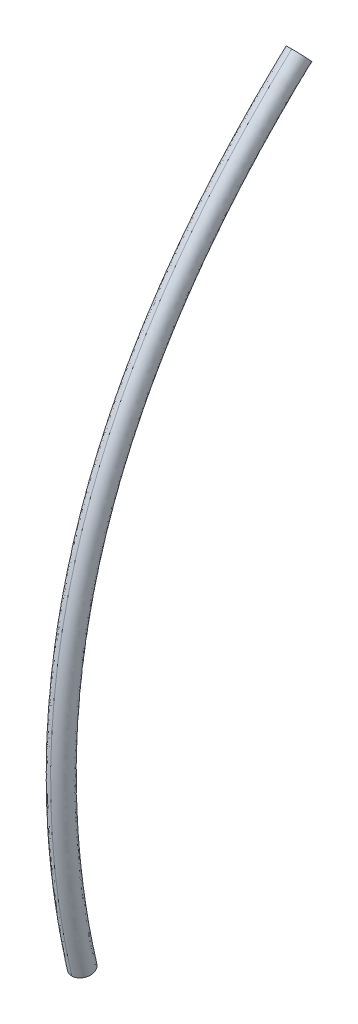
ISO-10303-21;
HEADER;
FILE_DESCRIPTION(('STEP AP214'),'2;1');
FILE_NAME('part.step','',(''),(''),'','','');
FILE_SCHEMA(('AUTOMOTIVE_DESIGN { 1 0 10303 214 1 1 1 1 }'));
ENDSEC;
DATA;
#1=APPLICATION_CONTEXT('core data for automotive mechanical design processes');
#2=APPLICATION_PROTOCOL_DEFINITION('international standard','automotive_design',2000,#1);
#3=PRODUCT_CONTEXT('',#1,'mechanical');
#4=PRODUCT('Part','Part','',(#3));
#5=PRODUCT_RELATED_PRODUCT_CATEGORY('part','',(#4));
#6=PRODUCT_DEFINITION_FORMATION('','',#4);
#7=PRODUCT_DEFINITION_CONTEXT('part definition',#1,'design');
#8=PRODUCT_DEFINITION('design','',#6,#7);
#9=PRODUCT_DEFINITION_SHAPE('','',#8);
#10=(LENGTH_UNIT() NAMED_UNIT(*) SI_UNIT(.MILLI.,.METRE.));
#11=(NAMED_UNIT(*) PLANE_ANGLE_UNIT() SI_UNIT($,.RADIAN.));
#12=(NAMED_UNIT(*) SI_UNIT($,.STERADIAN.) SOLID_ANGLE_UNIT());
#13=UNCERTAINTY_MEASURE_WITH_UNIT(LENGTH_MEASURE(1.E-05),#10,'distance_accuracy_value','');
#14=(GEOMETRIC_REPRESENTATION_CONTEXT(3) GLOBAL_UNCERTAINTY_ASSIGNED_CONTEXT((#13)) GLOBAL_UNIT_ASSIGNED_CONTEXT((#10,
#11,#12)) REPRESENTATION_CONTEXT('',''));
#15=CARTESIAN_POINT('',(0.,0.,0.));
#16=DIRECTION('',(0.,0.,1.));
#17=DIRECTION('',(1.,0.,0.));
#18=AXIS2_PLACEMENT_3D('',#15,#16,#17);
#19=CARTESIAN_POINT('',(-71.89158931535,31.2153070087,3.940002599999));
#20=DIRECTION('',(-3.37450176063713E-05,0.676622103447027,-0.736330447549329));
#21=DIRECTION('',(0.,0.736330447968568,0.67662210383227));
#22=AXIS2_PLACEMENT_3D('',#19,#20,#21);
#23=PLANE('',#22);
#24=CARTESIAN_POINT('',(-71.8915985028972,31.3993896203581,4.10915812607117));
#25=CARTESIAN_POINT('',(-71.9056627049007,31.399397713496,4.10916620748723));
#26=CARTESIAN_POINT('',(-71.9197232970163,31.3985148582398,4.10835558651192));
#27=CARTESIAN_POINT('',(-71.9474366475242,31.3950320780008,4.10515649171487));
#28=CARTESIAN_POINT('',(-71.9610896967661,31.3924334097169,4.10276917270087));
#29=CARTESIAN_POINT('',(-71.9876152248778,31.3855820653723,4.09647461306001));
#30=CARTESIAN_POINT('',(-72.0004873383897,31.3813286219244,4.09256666725597));
#31=CARTESIAN_POINT('',(-72.025076820214,31.3712922912606,4.08334530011746));
#32=CARTESIAN_POINT('',(-72.0367944147661,31.3655097045171,4.07803215490075));
#33=CARTESIAN_POINT('',(-72.0587383575653,31.3525820226663,4.0661537722847));
#34=CARTESIAN_POINT('',(-72.0689656000591,31.345437750592,4.05958929122033));
#35=CARTESIAN_POINT('',(-72.0876605661599,31.3299762300138,4.0453823875822));
#36=CARTESIAN_POINT('',(-72.0961258023464,31.3216573507353,4.03773846635778));
#37=CARTESIAN_POINT('',(-72.1110276587687,31.3041028159088,4.02160809519705));
#38=CARTESIAN_POINT('',(-72.1174670486452,31.2948684349217,4.01312281659556));
#39=CARTESIAN_POINT('',(-72.128157758151,31.2757221402713,3.99552956692825));
#40=CARTESIAN_POINT('',(-72.1324061168707,31.2658093301656,3.98642077197598));
#41=CARTESIAN_POINT('',(-72.1385787187361,31.2456059628344,3.96785595959955));
#42=CARTESIAN_POINT('',(-72.1405045241625,31.2353156643351,3.95840017999339));
#43=CARTESIAN_POINT('',(-72.1419826046852,31.2146431094734,3.93940401091891));
#44=CARTESIAN_POINT('',(-72.1415348797274,31.2042608531088,3.92986362144866));
#45=CARTESIAN_POINT('',(-72.1382774680916,31.1836921387668,3.91096265554266));
#46=CARTESIAN_POINT('',(-72.1354661913133,31.1735058173266,3.90160220449954));
#47=CARTESIAN_POINT('',(-72.1275648907312,31.1536392128044,3.88334620216467));
#48=CARTESIAN_POINT('',(-72.1224779385629,31.1439582671858,3.87445004220157));
#49=CARTESIAN_POINT('',(-72.1101617775071,31.1253492268747,3.85734942705056));
#50=CARTESIAN_POINT('',(-72.1029296363858,31.1164221842812,3.84914593851362));
#51=CARTESIAN_POINT('',(-72.0865428336147,31.0996015163003,3.83368849170903));
#52=CARTESIAN_POINT('',(-72.0773908718937,31.0917064646233,3.82643322293208));
#53=CARTESIAN_POINT('',(-72.0574037349204,31.0771485953598,3.81305492162478));
#54=CARTESIAN_POINT('',(-72.046566217646,31.0704875209944,3.80693349085206));
#55=CARTESIAN_POINT('',(-72.0235413560115,31.0586092308483,3.79601734489456));
#56=CARTESIAN_POINT('',(-72.011355927105,31.0533900021219,3.79122078007981));
#57=CARTESIAN_POINT('',(-71.9859508532943,31.0445239279692,3.78307248326935));
#58=CARTESIAN_POINT('',(-71.9727297145094,31.0408794050886,3.77972288541792));
#59=CARTESIAN_POINT('',(-71.945660491522,31.035283560126,3.77457956171973));
#60=CARTESIAN_POINT('',(-71.9318133990819,31.0333296519797,3.77278345955569));
#61=CARTESIAN_POINT('',(-71.9091218774411,31.0315624580655,3.77115852581408));
#62=CARTESIAN_POINT('',(-71.9003486755683,31.0312212099147,3.77084454709132));
#63=CARTESIAN_POINT('',(-71.8915801013255,31.0312243970436,3.77084707392716));
#64=B_SPLINE_CURVE_WITH_KNOTS('',3,(#24,#25,#26,#27,#28,#29,#30,#31,#32,#33,#34,#35,#36,#37,#38,
#39,#40,#41,#42,#43,#44,#45,#46,#47,#48,#49,#50,#51,#52,#53,#54,#55,#56,#57,#58,#59,#60,#61,#62,
#63),.UNSPECIFIED.,.F.,.F.,(4,2,2,2,2,2,2,2,2,2,2,2,2,2,2,2,2,2,2,4),(0.,0.0421365633228405,
0.0842422990895157,0.126367584333735,0.168484598219411,0.210576235910812,0.252726897195098,
0.294819679123878,0.336969196202288,0.379090345288036,0.421211495332161,0.463361005444274,
0.505453794321988,0.547604386585764,0.58969609331148,0.631846816313811,0.67393839227596,
0.716091839251991,0.758180691248295,0.784486390547571),.UNSPECIFIED.);
#65=CARTESIAN_POINT('',(-71.8915985028972,31.3993896203582,4.10915812607066));
#66=VERTEX_POINT('',#65);
#67=CARTESIAN_POINT('',(-71.8915801013255,31.0312243970432,3.77084707392589));
#68=VERTEX_POINT('',#67);
#69=EDGE_CURVE('E45',#66,#68,#64,.T.);
#70=ORIENTED_EDGE('',*,*,#69,.F.);
#71=CARTESIAN_POINT('',(-71.8915801013255,31.0312243970422,3.77084707392589));
#72=CARTESIAN_POINT('',(-71.8775158993207,31.0312163050009,3.77083899351744));
#73=CARTESIAN_POINT('',(-71.863455307332,31.0320991613533,3.77164961550012));
#74=CARTESIAN_POINT('',(-71.8357419573246,31.035581943753,3.7748487122827));
#75=CARTESIAN_POINT('',(-71.8220889084563,31.0381806131014,3.77723603227488));
#76=CARTESIAN_POINT('',(-71.7955633813295,31.0450319595141,3.78353059381619));
#77=CARTESIAN_POINT('',(-71.7826912684292,31.0492854039656,3.78743854054248));
#78=CARTESIAN_POINT('',(-71.7581017880479,31.0593217365465,3.79665990944275));
#79=CARTESIAN_POINT('',(-71.7463841943272,31.0651043242036,3.80197305549901));
#80=CARTESIAN_POINT('',(-71.7244402533869,31.0780320077653,3.81385143968731));
#81=CARTESIAN_POINT('',(-71.7142130119204,31.085176280637,3.82041592148446));
#82=CARTESIAN_POINT('',(-71.695518048043,31.1006378026728,3.83462282646207));
#83=CARTESIAN_POINT('',(-71.6870528130527,31.1089566826113,3.84226674829303));
#84=CARTESIAN_POINT('',(-71.6721509591547,31.1265112185996,3.85839712052148));
#85=CARTESIAN_POINT('',(-71.6657115706062,31.1357456000888,3.86688239958436));
#86=CARTESIAN_POINT('',(-71.6550208638536,31.1548918955726,3.88447565001769));
#87=CARTESIAN_POINT('',(-71.6507725065593,31.1648047060095,3.89358444527438));
#88=CARTESIAN_POINT('',(-71.6445999075992,31.185008073822,3.91214925809315));
#89=CARTESIAN_POINT('',(-71.6426741036525,31.1952983724714,3.92160503783733));
#90=CARTESIAN_POINT('',(-71.6411960261026,31.2159709274484,3.94060120701783));
#91=CARTESIAN_POINT('',(-71.6416437525534,31.226353183778,3.95014159645607));
#92=CARTESIAN_POINT('',(-71.6449011671473,31.2469218978657,3.96904256212854));
#93=CARTESIAN_POINT('',(-71.6477124453904,31.2571082190865,3.97840301297003));
#94=CARTESIAN_POINT('',(-71.6556137488295,31.2769748229921,3.99665901473842));
#95=CARTESIAN_POINT('',(-71.6607007023901,31.2866557682138,4.00555517433687));
#96=CARTESIAN_POINT('',(-71.6730168661218,31.3052648075641,4.02265578860514));
#97=CARTESIAN_POINT('',(-71.6802490085267,31.3141918495934,4.03085927662376));
#98=CARTESIAN_POINT('',(-71.6966358137165,31.3310125162963,4.04631672225406));
#99=CARTESIAN_POINT('',(-71.7057877765726,31.3389075672596,4.05357199037523));
#100=CARTESIAN_POINT('',(-71.7257749156395,31.3534654349652,4.06695029025106));
#101=CARTESIAN_POINT('',(-71.7366124338724,31.3601265084861,4.07307172024781));
#102=CARTESIAN_POINT('',(-71.7596372972164,31.3720047968376,4.08398786455629));
#103=CARTESIAN_POINT('',(-71.7718227268741,31.3772240246141,4.08878442849826));
#104=CARTESIAN_POINT('',(-71.7972278019721,31.3860900967908,4.09693272349293));
#105=CARTESIAN_POINT('',(-71.8104489412937,31.3897346186432,4.10028232039958));
#106=CARTESIAN_POINT('',(-71.8375181650969,31.3953304614937,4.10542564215699));
#107=CARTESIAN_POINT('',(-71.8513652578149,31.39728436856,4.1072217433286));
#108=CARTESIAN_POINT('',(-71.8740567621262,31.3990515593315,4.10884667418155));
#109=CARTESIAN_POINT('',(-71.8828299463016,31.3993928067877,4.10916065226525));
#110=CARTESIAN_POINT('',(-71.8915985028971,31.3993896203567,4.10915812606985));
#111=B_SPLINE_CURVE_WITH_KNOTS('',3,(#71,#72,#73,#74,#75,#76,#77,#78,#79,#80,#81,#82,#83,#84,
#85,#86,#87,#88,#89,#90,#91,#92,#93,#94,#95,#96,#97,#98,#99,#100,#101,#102,#103,#104,#105,#106,
#107,#108,#109,#110),.UNSPECIFIED.,.F.,.F.,(4,2,2,2,2,2,2,2,2,2,2,2,2,2,2,2,2,2,2,4),(0.,
0.0421365633230519,0.0842422990899736,0.126367584334418,0.168484598220306,0.210576235911809,
0.252726897196176,0.294819679124971,0.336969196203423,0.37909034528927,0.421211495333465,
0.463361005444602,0.505453794321359,0.547604386584339,0.589696093309071,0.631846816314479,
0.673938392276347,0.716091839300921,0.75818069125102,0.784486337678304),.UNSPECIFIED.);
#112=EDGE_CURVE('E55',#68,#66,#111,.T.);
#113=ORIENTED_EDGE('',*,*,#112,.F.);
#114=EDGE_LOOP('',(#70,#113));
#115=FACE_BOUND('',#114,.T.);
#116=ADVANCED_FACE('F17',(#115),#23,.T.);
#117=CARTESIAN_POINT('',(-71.87003044763,15.10063833545,8.737419710806));
#118=CARTESIAN_POINT('',(-71.87003328653,15.15748307275,8.750926323371));
#119=CARTESIAN_POINT('',(-71.87010384542,16.57168130498,9.080901965091));
#120=CARTESIAN_POINT('',(-71.87024258999,19.35463551411,9.422687421576));
#121=CARTESIAN_POINT('',(-71.87044063809,23.32540682278,8.937735265622));
#122=CARTESIAN_POINT('',(-71.87063855051,27.29231680901,7.219236763469));
#123=CARTESIAN_POINT('',(-71.87076552618,29.83920005819,5.079698170652));
#124=CARTESIAN_POINT('',(-71.87082892875,31.11090411614,3.685080689482));
#125=CARTESIAN_POINT('',(-71.87083089292,31.15032055346,3.641521866132));
#126=CARTESIAN_POINT('',(-72.02577822116,15.10362997508,8.72479608301));
#127=CARTESIAN_POINT('',(-72.02578102916,15.16044072749,8.738294621932));
#128=CARTESIAN_POINT('',(-72.02585132862,16.5737873244,9.068071542992));
#129=CARTESIAN_POINT('',(-72.02599034233,19.35475574699,9.409580594666));
#130=CARTESIAN_POINT('',(-72.02618810075,23.3219363323,8.925030849315));
#131=CARTESIAN_POINT('',(-72.02638529358,27.28519722054,7.20815229394));
#132=CARTESIAN_POINT('',(-72.02651251458,29.83031111924,5.070180947851));
#133=CARTESIAN_POINT('',(-72.02657603772,31.10129764379,3.676350378446));
#134=CARTESIAN_POINT('',(-72.02657801305,31.14069200991,3.632815944906));
#135=CARTESIAN_POINT('',(-72.14078463519,15.07916101315,8.827754648646));
#136=CARTESIAN_POINT('',(-72.14078743544,15.13624894699,8.841319036362));
#137=CARTESIAN_POINT('',(-72.14085792112,16.55654149901,9.172716727176));
#138=CARTESIAN_POINT('',(-72.14099801444,19.3537060369,9.516480142121));
#139=CARTESIAN_POINT('',(-72.14119715177,23.35017263521,9.028648327694));
#140=CARTESIAN_POINT('',(-72.14139543194,27.34319564128,7.298557453372));
#141=CARTESIAN_POINT('',(-72.14152361895,29.90274039844,5.147803611023));
#142=CARTESIAN_POINT('',(-72.14158754943,31.17957913992,3.747554973224));
#143=CARTESIAN_POINT('',(-72.14158954278,31.2191535192,3.703821615895));
#144=CARTESIAN_POINT('',(-72.14078283337,15.04303259343,8.979808602883));
#145=CARTESIAN_POINT('',(-72.14078565403,15.10052988157,8.99347023913));
#146=CARTESIAN_POINT('',(-72.14085665131,16.53108054015,9.327261557407));
#147=CARTESIAN_POINT('',(-72.14099793755,19.35216424749,9.674354319914));
#148=CARTESIAN_POINT('',(-72.14119923192,23.39188177935,9.181675394633));
#149=CARTESIAN_POINT('',(-72.1413997042,27.42885885248,7.432071958844));
#150=CARTESIAN_POINT('',(-72.14152895411,30.00971576644,5.262440336979));
#151=CARTESIAN_POINT('',(-72.14159331563,31.29519733158,3.852713200022));
#152=CARTESIAN_POINT('',(-72.14159532224,31.33503756258,3.808686062873));
#153=CARTESIAN_POINT('',(-72.14078103154,15.00690417371,9.13186255712));
#154=CARTESIAN_POINT('',(-72.14078387263,15.06481081615,9.145621441899));
#155=CARTESIAN_POINT('',(-72.1408553815,16.50561958129,9.481806387637));
#156=CARTESIAN_POINT('',(-72.14099786066,19.35062245808,9.832228497708));
#157=CARTESIAN_POINT('',(-72.14120131207,23.43359092349,9.334702461572));
#158=CARTESIAN_POINT('',(-72.14140397646,27.51452206368,7.565586464315));
#159=CARTESIAN_POINT('',(-72.14153428927,30.11669113444,5.377077062935));
#160=CARTESIAN_POINT('',(-72.14159908183,31.41081552323,3.957871426819));
#161=CARTESIAN_POINT('',(-72.1416011017,31.45092160595,3.913550509852));
#162=CARTESIAN_POINT('',(-72.02577217742,14.98244668328,9.234821122756));
#163=CARTESIAN_POINT('',(-72.02577505389,15.04063050714,9.248645856328));
#164=CARTESIAN_POINT('',(-72.02584706938,16.48838522737,9.586451571821));
#165=CARTESIAN_POINT('',(-72.02599008441,19.34958421949,9.939128045162));
#166=CARTESIAN_POINT('',(-72.02619507807,23.4618386979,9.438319939951));
#167=CARTESIAN_POINT('',(-72.02639962376,27.57253195588,7.655991623747));
#168=CARTESIAN_POINT('',(-72.02653040996,30.18913188512,5.454699726106));
#169=CARTESIAN_POINT('',(-72.02659537892,31.48910849086,4.029076021598));
#170=CARTESIAN_POINT('',(-72.02659739872,31.52939458674,3.984556180841));
#171=CARTESIAN_POINT('',(-71.87002470307,14.98545385803,9.22219749496));
#172=CARTESIAN_POINT('',(-71.87002760705,15.04360369701,9.236014154889));
#173=CARTESIAN_POINT('',(-71.87009979703,16.4905067819,9.573621149722));
#174=CARTESIAN_POINT('',(-71.87024234484,19.34971998752,9.926021218252));
#175=CARTESIAN_POINT('',(-71.87044727002,23.45838374255,9.425615523643));
#176=CARTESIAN_POINT('',(-71.87065217132,27.56542790249,7.644907154218));
#177=CARTESIAN_POINT('',(-71.87078253571,30.18025848128,5.445182503305));
#178=CARTESIAN_POINT('',(-71.87084731252,31.47951755364,4.020345710561));
#179=CARTESIAN_POINT('',(-71.87084931896,31.51978157832,3.975850259615));
#180=(BOUNDED_SURFACE() B_SPLINE_SURFACE(3,3,((#117,#118,#119,#120,#121,#122,#123,#124,#125),
(#126,#127,#128,#129,#130,#131,#132,#133,#134),(#135,#136,#137,#138,#139,#140,#141,#142,#143),
(#144,#145,#146,#147,#148,#149,#150,#151,#152),(#153,#154,#155,#156,#157,#158,#159,#160,#161),
(#162,#163,#164,#165,#166,#167,#168,#169,#170),(#171,#172,#173,#174,#175,#176,#177,#178,#179)),
.UNSPECIFIED.,.F.,.F.,.F.) B_SPLINE_SURFACE_WITH_KNOTS((4,3,4),(4,1,1,1,1,1,4),(0.,1.,2.),
(-0.009188194403795,0.,0.2197220715086,0.4577543156428,0.7180322441343,1.,1.009035688199),
.UNSPECIFIED.) GEOMETRIC_REPRESENTATION_ITEM() RATIONAL_B_SPLINE_SURFACE(((1.192521483357,
1.192521483357,1.192521483357,1.192521483357,1.192521483357,1.192521483357,1.192521483357,
1.192521483357,1.192521483357),(0.9358261722145,0.9358261722145,0.9358261722145,0.9358261722145,
0.9358261722145,0.9358261722145,0.9358261722145,0.9358261722145,0.9358261722145),
(0.9358261722145,0.9358261722145,0.9358261722145,0.9358261722145,0.9358261722145,
0.9358261722145,0.9358261722145,0.9358261722145,0.9358261722145),(1.192521483357,1.192521483357,
1.192521483357,1.192521483357,1.192521483357,1.192521483357,1.192521483357,1.192521483357,
1.192521483357),(0.9358261722145,0.9358261722145,0.9358261722145,0.9358261722145,
0.9358261722145,0.9358261722145,0.9358261722145,0.9358261722145,0.9358261722145),
(0.9358261722145,0.9358261722145,0.9358261722145,0.9358261722145,0.9358261722145,
0.9358261722145,0.9358261722145,0.9358261722145,0.9358261722145),(1.192521483357,1.192521483357,
1.192521483357,1.192521483357,1.192521483357,1.192521483357,1.192521483357,1.192521483357,1.192521483357))) REPRESENTATION_ITEM('') SURFACE());
#181=CARTESIAN_POINT('',(-71.8907856421035,15.100836807745,8.73658004246828));
#182=CARTESIAN_POINT('',(-71.8907884769927,15.157679284519,8.75008611800995));
#183=CARTESIAN_POINT('',(-71.8908590041491,16.571820869703,9.08004854170349));
#184=CARTESIAN_POINT('',(-71.8909977911969,19.3546429930183,9.42181561295311));
#185=CARTESIAN_POINT('',(-71.8911958126441,23.325175462522,8.93689022358697));
#186=CARTESIAN_POINT('',(-71.8913936413216,27.2918427267683,7.21849947318648));
#187=CARTESIAN_POINT('',(-71.8915206555703,29.8386082865201,5.0790651267459));
#188=CARTESIAN_POINT('',(-71.8915840765926,31.1102646172882,3.68449998749413));
#189=CARTESIAN_POINT('',(-71.8915860423258,31.1496795865288,3.64094278644728));
#190=(BOUNDED_CURVE() B_SPLINE_CURVE(3,(#181,#182,#183,#184,#185,#186,#187,#188,#189),
.UNSPECIFIED.,.F.,.F.) B_SPLINE_CURVE_WITH_KNOTS((4,1,1,1,1,1,4),(-0.009188194403795,0.,
0.2197220715086,0.4577543156428,0.7180322441343,1.,1.009035688199),
.UNSPECIFIED.) CURVE() GEOMETRIC_REPRESENTATION_ITEM() RATIONAL_B_SPLINE_CURVE((1.1521574413996,
1.1521574413996,1.1521574413996,1.1521574413996,1.1521574413996,1.1521574413996,1.1521574413996,
1.1521574413996,1.1521574413996)) REPRESENTATION_ITEM(''));
#191=CARTESIAN_POINT('',(-71.890794118083,15.2711228978366,8.77631306650731));
#192=VERTEX_POINT('',#191);
#193=EDGE_CURVE('E49',#192,#68,#190,.T.);
#194=CARTESIAN_POINT('',(-71.8907941180829,15.2711228978371,8.77631306650757));
#195=CARTESIAN_POINT('',(-71.9048583197793,15.2711248633183,8.77630142293598));
#196=CARTESIAN_POINT('',(-71.9189189426626,15.2708566835869,8.77746922178934));
#197=CARTESIAN_POINT('',(-71.9466324145956,15.2697997038891,8.78207791242598));
#198=CARTESIAN_POINT('',(-71.9602855544508,15.2690112849575,8.78551714056533));
#199=CARTESIAN_POINT('',(-71.9868113214799,15.2669329608803,8.79458523267487));
#200=CARTESIAN_POINT('',(-71.9996835833226,15.2656428230671,8.80021511254037));
#201=CARTESIAN_POINT('',(-72.0242734151552,15.262598843397,8.81349963434798));
#202=CARTESIAN_POINT('',(-72.0359912113742,15.2608450926389,8.82115387850816));
#203=CARTESIAN_POINT('',(-72.0579356050317,15.2569245154136,8.83826616118293));
#204=CARTESIAN_POINT('',(-72.0681630966882,15.254757938468,8.847723110103));
#205=CARTESIAN_POINT('',(-72.0868586020292,15.2500691863489,8.86818991665913));
#206=CARTESIAN_POINT('',(-72.0953241283502,15.247546516793,8.87920193328773));
#207=CARTESIAN_POINT('',(-72.1102265970208,15.2422232715011,8.902439733928));
#208=CARTESIAN_POINT('',(-72.1166663089668,15.2394230821298,8.91466383048625));
#209=CARTESIAN_POINT('',(-72.1273576862469,15.2336173440301,8.94000908959618));
#210=CARTESIAN_POINT('',(-72.1316063907028,15.2306115235932,8.95313143905884));
#211=CARTESIAN_POINT('',(-72.1377796972199,15.2244854263602,8.97987635527105));
#212=CARTESIAN_POINT('',(-72.1397058615527,15.2213652279583,8.99349857941409));
#213=CARTESIAN_POINT('',(-72.1411846631007,15.2150970309527,9.02086491892725));
#214=CARTESIAN_POINT('',(-72.1407373002618,15.2119490323484,9.03460903430015));
#215=CARTESIAN_POINT('',(-72.1374806060381,15.2057124853911,9.0618382222674));
#216=CARTESIAN_POINT('',(-72.134669684548,15.2026239784929,9.07532311421823));
#217=CARTESIAN_POINT('',(-72.1267690768952,15.1966004802248,9.10162315252605));
#218=CARTESIAN_POINT('',(-72.1216824623911,15.1936652878599,9.11443917574938));
#219=CARTESIAN_POINT('',(-72.1093669504101,15.1880232502001,9.13907473579464));
#220=CARTESIAN_POINT('',(-72.1021351206634,15.1853167240151,9.1508928800364));
#221=CARTESIAN_POINT('',(-72.0857489046009,15.1802170818601,9.1731612524731));
#222=CARTESIAN_POINT('',(-72.0765972182639,15.1778235333298,9.18361336861912));
#223=CARTESIAN_POINT('',(-72.0566105890827,15.173410121636,9.2028864742026));
#224=CARTESIAN_POINT('',(-72.0457733041554,15.1713907871177,9.21170515610947));
#225=CARTESIAN_POINT('',(-72.0227488568582,15.1677899587404,9.22743122155017));
#226=CARTESIAN_POINT('',(-72.010563610012,15.1662078544676,9.23434126970547));
#227=CARTESIAN_POINT('',(-71.9851588454788,15.1635204457253,9.24607990508167));
#228=CARTESIAN_POINT('',(-71.9719378338299,15.1624158455292,9.25090541780242));
#229=CARTESIAN_POINT('',(-71.944868806062,15.1607200639887,9.25831501653826));
#230=CARTESIAN_POINT('',(-71.9310217817959,15.1601280984867,9.26090252593422));
#231=CARTESIAN_POINT('',(-71.9083303250918,15.1595930540328,9.26324344644287));
#232=CARTESIAN_POINT('',(-71.8995571384269,15.1594898885378,9.26369577257006));
#233=CARTESIAN_POINT('',(-71.8907885673601,15.1594911593634,9.26369213349179));
#234=B_SPLINE_CURVE_WITH_KNOTS('',3,(#194,#195,#196,#197,#198,#199,#200,#201,#202,#203,#204,
#205,#206,#207,#208,#209,#210,#211,#212,#213,#214,#215,#216,#217,#218,#219,#220,#221,#222,#223,
#224,#225,#226,#227,#228,#229,#230,#231,#232,#233),.UNSPECIFIED.,.F.,.F.,(4,2,2,2,2,2,2,2,2,2,2,
2,2,2,2,2,2,2,2,4),(0.,0.0421365633215245,0.084242299086954,0.126367584330018,0.168484598214511,
0.210576235903639,0.252726897185607,0.294819679112891,0.336969196189856,0.379090345276051,
0.421211495320628,0.463361005440192,0.505453794325288,0.547604386584579,0.589696093305809,
0.631846816306779,0.673938392266929,0.716091839251998,0.75818069123981,0.784486380735924),.UNSPECIFIED.);
#235=CARTESIAN_POINT('',(-71.8907885673601,15.1594911593607,9.26369213349143));
#236=VERTEX_POINT('',#235);
#237=EDGE_CURVE('E38',#192,#236,#234,.T.);
#238=CARTESIAN_POINT('',(-71.8916045322028,31.5204204750082,3.97642933929972));
#239=CARTESIAN_POINT('',(-71.8916025240522,31.4801549822487,4.02092641254899));
#240=CARTESIAN_POINT('',(-71.8915377240282,30.1808481827242,5.44581554721111));
#241=CARTESIAN_POINT('',(-71.891407309321,27.565899914502,7.64564444450053));
#242=CARTESIAN_POINT('',(-71.8912024675532,23.4586130325738,9.42646056567815));
#243=CARTESIAN_POINT('',(-71.8909975452027,19.34971043837,9.92689302687489));
#244=CARTESIAN_POINT('',(-71.8908549417304,16.4903651469413,9.57447457310963));
#245=CARTESIAN_POINT('',(-71.8907827778433,15.0434054150067,9.23685436025006));
#246=CARTESIAN_POINT('',(-71.8907798776386,14.9852533155108,9.22303716329772));
#247=(BOUNDED_CURVE() B_SPLINE_CURVE(3,(#238,#239,#240,#241,#242,#243,#244,#245,#246),
.UNSPECIFIED.,.F.,.F.) B_SPLINE_CURVE_WITH_KNOTS((4,1,1,1,1,1,4),(-0.00918819440379504,
-0.000152506204795122,0.281815249660905,0.542093178152405,0.780125422286605,0.999847493795205,
1.009035688199),
.UNSPECIFIED.) CURVE() GEOMETRIC_REPRESENTATION_ITEM() RATIONAL_B_SPLINE_CURVE((1.15215744140925,
1.15215744140925,1.15215744140925,1.15215744140925,1.15215744140925,1.15215744140925,
1.15215744140925,1.15215744140925,1.15215744140925)) REPRESENTATION_ITEM(''));
#248=EDGE_CURVE('E30',#66,#236,#247,.T.);
#249=ORIENTED_EDGE('',*,*,#193,.F.);
#250=ORIENTED_EDGE('',*,*,#237,.T.);
#251=ORIENTED_EDGE('',*,*,#248,.F.);
#252=ORIENTED_EDGE('',*,*,#69,.T.);
#253=EDGE_LOOP('',(#249,#250,#251,#252));
#254=FACE_BOUND('',#253,.T.);
#255=ADVANCED_FACE('F47',(#254),#180,.T.);
#256=CARTESIAN_POINT('',(-71.89079135105,15.2153070286,9.020002599999));
#257=DIRECTION('',(-4.86138868145315E-05,0.974758132756431,0.223263477223407));
#258=DIRECTION('',(0.,-0.223263477487227,0.974758133908258));
#259=AXIS2_PLACEMENT_3D('',#256,#257,#258);
#260=PLANE('',#259);
#261=CARTESIAN_POINT('',(-71.8907885673601,15.1594911593633,9.26369213349253));
#262=CARTESIAN_POINT('',(-71.8767243656631,15.1594891940912,9.26370377615103));
#263=CARTESIAN_POINT('',(-71.8626637428597,15.1597573740317,9.26253597638484));
#264=CARTESIAN_POINT('',(-71.8349502712419,15.1608143541415,9.25792728394902));
#265=CARTESIAN_POINT('',(-71.8212971316217,15.1616027732761,9.25448805492331));
#266=CARTESIAN_POINT('',(-71.7947713652124,15.1636810977477,9.24541996109172));
#267=CARTESIAN_POINT('',(-71.7818991037545,15.1649712357523,9.23979008039055));
#268=CARTESIAN_POINT('',(-71.7573092728298,15.168015215788,9.22650555698659));
#269=CARTESIAN_POINT('',(-71.7455914771339,15.1697689667203,9.21885131206571));
#270=CARTESIAN_POINT('',(-71.7236470846458,15.1736895442719,9.20173902796637));
#271=CARTESIAN_POINT('',(-71.7134195936357,15.1758561213695,9.19228207838239));
#272=CARTESIAN_POINT('',(-71.6947240896934,15.1805448737665,9.17181527061269));
#273=CARTESIAN_POINT('',(-71.686258564125,15.1830675434482,9.16080325343459));
#274=CARTESIAN_POINT('',(-71.6713560970422,15.1883907889615,9.13756545182701));
#275=CARTESIAN_POINT('',(-71.6649163859315,15.1911909784285,9.12534135485077));
#276=CARTESIAN_POINT('',(-71.6542250103832,15.1969967166872,9.09999609504693));
#277=CARTESIAN_POINT('',(-71.6499763068239,15.2000025371871,9.08687374530855));
#278=CARTESIAN_POINT('',(-71.6438030021339,15.2061286345119,9.06012882869543));
#279=CARTESIAN_POINT('',(-71.6418768387316,15.2092488329424,9.04650660442707));
#280=CARTESIAN_POINT('',(-71.6403980390537,15.21551702997,9.01914026481736));
#281=CARTESIAN_POINT('',(-71.6408454028322,15.2186650285677,9.00539614947323));
#282=CARTESIAN_POINT('',(-71.6441020989171,15.2249015754762,8.9781669617188));
#283=CARTESIAN_POINT('',(-71.6469130213285,15.2279900823322,8.96468206995211));
#284=CARTESIAN_POINT('',(-71.6548136307773,15.234013580482,8.93838203216023));
#285=CARTESIAN_POINT('',(-71.6599002461562,15.2369487727709,8.92556600926851));
#286=CARTESIAN_POINT('',(-71.6722157598194,15.2425908102475,8.90093045002241));
#287=CARTESIAN_POINT('',(-71.679447590374,15.2452973363254,8.88911230624863));
#288=CARTESIAN_POINT('',(-71.6958338079591,15.2503969782372,8.86684393487289));
#289=CARTESIAN_POINT('',(-71.7049854950109,15.2527905266317,8.85639181931967));
#290=CARTESIAN_POINT('',(-71.7249721255103,15.2572039380287,8.83711871503171));
#291=CARTESIAN_POINT('',(-71.7358094110407,15.259223272386,8.82830003382766));
#292=CARTESIAN_POINT('',(-71.7588338594139,15.2628241004212,8.81257396988071));
#293=CARTESIAN_POINT('',(-71.771019106733,15.2644062045128,8.80566392251613));
#294=CARTESIAN_POINT('',(-71.7964238720759,15.2670936128781,8.79392528878544));
#295=CARTESIAN_POINT('',(-71.8096448840622,15.2681982128782,8.78909977692101));
#296=CARTESIAN_POINT('',(-71.8367139123426,15.2698939940157,8.78169017994414));
#297=CARTESIAN_POINT('',(-71.8505609367832,15.2704859593117,8.77910267144762));
#298=CARTESIAN_POINT('',(-71.8732523825855,15.2710210031665,8.7767617535567));
#299=CARTESIAN_POINT('',(-71.8820255581175,15.2711241685294,8.7763094280086));
#300=CARTESIAN_POINT('',(-71.8907941180829,15.2711228978374,8.77631306650635));
#301=B_SPLINE_CURVE_WITH_KNOTS('',3,(#261,#262,#263,#264,#265,#266,#267,#268,#269,#270,#271,
#272,#273,#274,#275,#276,#277,#278,#279,#280,#281,#282,#283,#284,#285,#286,#287,#288,#289,#290,
#291,#292,#293,#294,#295,#296,#297,#298,#299,#300),.UNSPECIFIED.,.F.,.F.,(4,2,2,2,2,2,2,2,2,2,2,
2,2,2,2,2,2,2,2,4),(0.,0.0421365633212228,0.08424229908638,0.126367584329153,0.168484598213334,
0.210576235902004,0.252726897183528,0.294819679110515,0.336969196187181,0.379090345274195,
0.421211495319563,0.463361005434216,0.505453794314477,0.547604386578271,0.589696093303839,
0.631846816307903,0.673938392269047,0.716091839283598,0.758180691241282,0.784486347477179),.UNSPECIFIED.);
#302=EDGE_CURVE('E11',#236,#192,#301,.T.);
#303=ORIENTED_EDGE('',*,*,#302,.F.);
#304=ORIENTED_EDGE('',*,*,#237,.F.);
#305=EDGE_LOOP('',(#303,#304));
#306=FACE_BOUND('',#305,.T.);
#307=ADVANCED_FACE('F78',(#306),#260,.F.);
#308=CARTESIAN_POINT('',(-71.9115350721,14.9854517878,9.22219749496));
#309=CARTESIAN_POINT('',(-71.9115379683,15.04360162677,9.236014154889));
#310=CARTESIAN_POINT('',(-71.91161010045,16.49050471166,9.573621149722));
#311=CARTESIAN_POINT('',(-71.9117527464,19.34971791728,9.926021218252));
#312=CARTESIAN_POINT('',(-71.9119576421,23.45838167232,9.425615523643));
#313=CARTESIAN_POINT('',(-71.91216240012,27.56542583226,7.644907154218));
#314=CARTESIAN_POINT('',(-71.91229285341,30.18025641105,5.445182503305));
#315=CARTESIAN_POINT('',(-71.91235767189,31.4795154834,4.020345710561));
#316=CARTESIAN_POINT('',(-71.9123596816,31.51977950808,3.975850259615));
#317=CARTESIAN_POINT('',(-71.75578729857,14.98246014817,9.234821122756));
#318=CARTESIAN_POINT('',(-71.75579022567,15.04064397203,9.248645856328));
#319=CARTESIAN_POINT('',(-71.75586261725,16.48839869224,9.586451571822));
#320=CARTESIAN_POINT('',(-71.75600499405,19.34959768439,9.939128045162));
#321=CARTESIAN_POINT('',(-71.75621017943,23.46185216279,9.438319939951));
#322=CARTESIAN_POINT('',(-71.75641565705,27.57254542073,7.655991623747));
#323=CARTESIAN_POINT('',(-71.75654586501,30.18914535,5.454699726106));
#324=CARTESIAN_POINT('',(-71.75661056292,31.48912195575,4.029076021598));
#325=CARTESIAN_POINT('',(-71.75661256148,31.52940805163,3.984556180841));
#326=CARTESIAN_POINT('',(-71.64078088455,15.0069291101,9.13186255712));
#327=CARTESIAN_POINT('',(-71.64078381939,15.06483575253,9.145621441899));
#328=CARTESIAN_POINT('',(-71.64085602476,16.50564451764,9.481806387637));
#329=CARTESIAN_POINT('',(-71.64099732194,19.35064739449,9.832228497707));
#330=CARTESIAN_POINT('',(-71.64120112842,23.43361585988,9.334702461572));
#331=CARTESIAN_POINT('',(-71.64140551869,27.51454699999,7.565586464316));
#332=CARTESIAN_POINT('',(-71.64153476064,30.1167160708,5.377077062935));
#333=CARTESIAN_POINT('',(-71.64159905121,31.41084045961,3.957871426819));
#334=CARTESIAN_POINT('',(-71.64160103174,31.45094654234,3.913550509852));
#335=CARTESIAN_POINT('',(-71.64078268637,15.04305752982,8.979808602883));
#336=CARTESIAN_POINT('',(-71.6407856008,15.10055481796,8.99347023913));
#337=CARTESIAN_POINT('',(-71.64085729457,16.5311054765,9.327261557407));
#338=CARTESIAN_POINT('',(-71.64099739884,19.3521891839,9.674354319914));
#339=CARTESIAN_POINT('',(-71.64119904827,23.39190671574,9.181675394633));
#340=CARTESIAN_POINT('',(-71.64140124643,27.42888378879,7.432071958844));
#341=CARTESIAN_POINT('',(-71.64152942548,30.0097407028,5.262440336979));
#342=CARTESIAN_POINT('',(-71.64159328501,31.29522226796,3.852713200022));
#343=CARTESIAN_POINT('',(-71.64159525229,31.33506249896,3.808686062873));
#344=CARTESIAN_POINT('',(-71.6407844882,15.07918594954,8.827754648646));
#345=CARTESIAN_POINT('',(-71.64078738221,15.13627388338,8.841319036362));
#346=CARTESIAN_POINT('',(-71.64085856438,16.55656643536,9.172716727176));
#347=CARTESIAN_POINT('',(-71.64099747573,19.35373097331,9.516480142121));
#348=CARTESIAN_POINT('',(-71.64119696812,23.35019757161,9.028648327694));
#349=CARTESIAN_POINT('',(-71.64139697417,27.34322057759,7.298557453372));
#350=CARTESIAN_POINT('',(-71.64152409032,29.9027653348,5.147803611023));
#351=CARTESIAN_POINT('',(-71.64158751881,31.17960407631,3.747554973224));
#352=CARTESIAN_POINT('',(-71.64158947283,31.21917845559,3.703821615895));
#353=CARTESIAN_POINT('',(-71.75579334232,15.10364343997,8.72479608301));
#354=CARTESIAN_POINT('',(-71.75579620094,15.16045419238,8.738294621932));
#355=CARTESIAN_POINT('',(-71.75586687649,16.57380078928,9.068071542992));
#356=CARTESIAN_POINT('',(-71.75600525197,19.3547692119,9.409580594666));
#357=CARTESIAN_POINT('',(-71.75620320211,23.32194979719,8.925030849315));
#358=CARTESIAN_POINT('',(-71.75640132687,27.28521068539,7.20815229394));
#359=CARTESIAN_POINT('',(-71.75652796963,29.83032458412,5.070180947851));
#360=CARTESIAN_POINT('',(-71.75659122172,31.10131110868,3.676350378446));
#361=CARTESIAN_POINT('',(-71.7565931758,31.1407054748,3.632815944906));
#362=CARTESIAN_POINT('',(-71.91154081667,15.10063626522,8.737419710806));
#363=CARTESIAN_POINT('',(-71.91154364778,15.15748100252,8.750926323371));
#364=CARTESIAN_POINT('',(-71.91161414885,16.57167923475,9.080901965091));
#365=CARTESIAN_POINT('',(-71.91175299155,19.35463344387,9.422687421576));
#366=CARTESIAN_POINT('',(-71.91195101017,23.32540475254,8.937735265622));
#367=CARTESIAN_POINT('',(-71.91214877931,27.29231473878,7.219236763469));
#368=CARTESIAN_POINT('',(-71.91227584388,29.83919798796,5.079698170652));
#369=CARTESIAN_POINT('',(-71.91233928812,31.1109020459,3.685080689482));
#370=CARTESIAN_POINT('',(-71.91234125556,31.15031848322,3.641521866132));
#371=(BOUNDED_SURFACE() B_SPLINE_SURFACE(3,3,((#308,#309,#310,#311,#312,#313,#314,#315,#316),
(#317,#318,#319,#320,#321,#322,#323,#324,#325),(#326,#327,#328,#329,#330,#331,#332,#333,#334),
(#335,#336,#337,#338,#339,#340,#341,#342,#343),(#344,#345,#346,#347,#348,#349,#350,#351,#352),
(#353,#354,#355,#356,#357,#358,#359,#360,#361),(#362,#363,#364,#365,#366,#367,#368,#369,#370)),
.UNSPECIFIED.,.F.,.F.,.F.) B_SPLINE_SURFACE_WITH_KNOTS((4,3,4),(4,1,1,1,1,1,4),(0.,1.,2.),
(-0.009188194403795,0.,0.2197220715086,0.4577543156428,0.7180322441343,1.,1.009035688199),
.UNSPECIFIED.) GEOMETRIC_REPRESENTATION_ITEM() RATIONAL_B_SPLINE_SURFACE(((1.192521483357,
1.192521483357,1.192521483357,1.192521483357,1.192521483357,1.192521483357,1.192521483357,
1.192521483357,1.192521483357),(0.9358261722145,0.9358261722145,0.9358261722145,0.9358261722145,
0.9358261722145,0.9358261722145,0.9358261722145,0.9358261722145,0.9358261722145),
(0.9358261722145,0.9358261722145,0.9358261722145,0.9358261722145,0.9358261722145,
0.9358261722145,0.9358261722145,0.9358261722145,0.9358261722145),(1.192521483357,1.192521483357,
1.192521483357,1.192521483357,1.192521483357,1.192521483357,1.192521483357,1.192521483357,
1.192521483357),(0.9358261722145,0.9358261722145,0.9358261722145,0.9358261722145,
0.9358261722145,0.9358261722145,0.9358261722145,0.9358261722145,0.9358261722145),
(0.9358261722145,0.9358261722145,0.9358261722145,0.9358261722145,0.9358261722145,
0.9358261722145,0.9358261722145,0.9358261722145,0.9358261722145),(1.192521483357,1.192521483357,
1.192521483357,1.192521483357,1.192521483357,1.192521483357,1.192521483357,1.192521483357,1.192521483357))) REPRESENTATION_ITEM('') SURFACE());
#372=ORIENTED_EDGE('',*,*,#248,.T.);
#373=ORIENTED_EDGE('',*,*,#302,.T.);
#374=ORIENTED_EDGE('',*,*,#193,.T.);
#375=ORIENTED_EDGE('',*,*,#112,.T.);
#376=EDGE_LOOP('',(#372,#373,#374,#375));
#377=FACE_BOUND('',#376,.T.);
#378=ADVANCED_FACE('F59',(#377),#371,.T.);
#379=CLOSED_SHELL('',(#116,#255,#307,#378));
#380=MANIFOLD_SOLID_BREP('B1',#379);
#381=ADVANCED_BREP_SHAPE_REPRESENTATION('',(#18,#380),#14);
#382=SHAPE_DEFINITION_REPRESENTATION(#9,#381);
ENDSEC;
END-ISO-10303-21;
